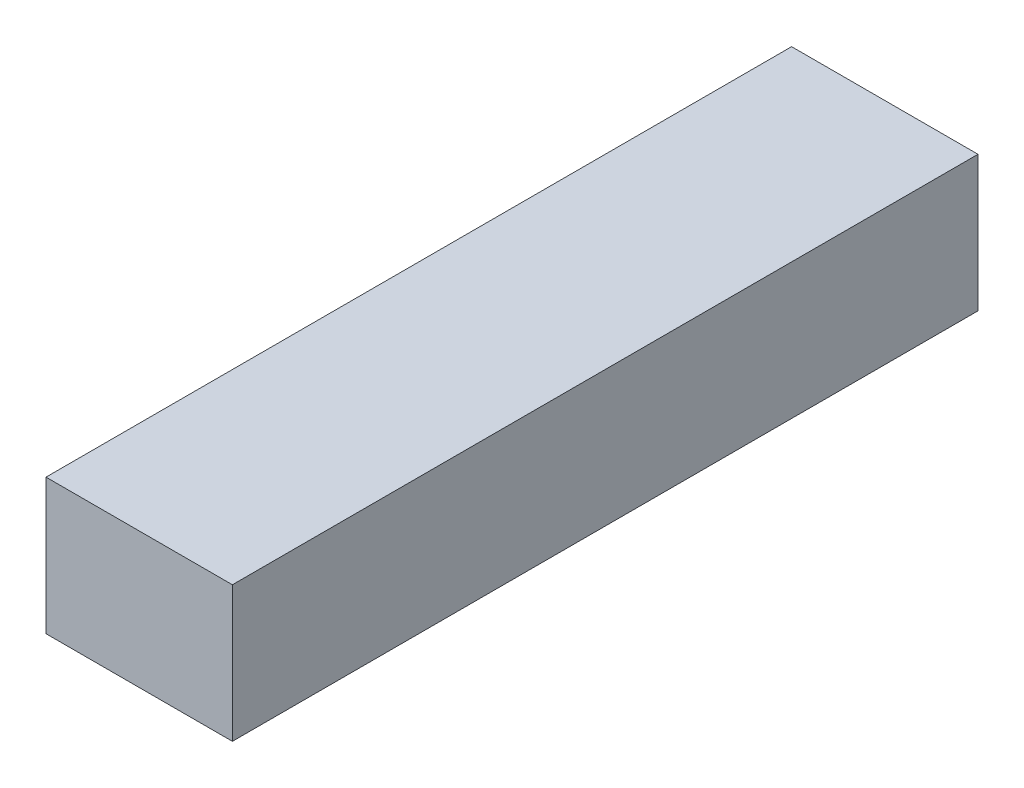
ISO-10303-21;
HEADER;
FILE_DESCRIPTION(('STEP AP214'),'2;1');
FILE_NAME('part.step','',(''),(''),'','','');
FILE_SCHEMA(('AUTOMOTIVE_DESIGN { 1 0 10303 214 1 1 1 1 }'));
ENDSEC;
DATA;
#1=APPLICATION_CONTEXT('core data for automotive mechanical design processes');
#2=APPLICATION_PROTOCOL_DEFINITION('international standard','automotive_design',2000,#1);
#3=PRODUCT_CONTEXT('',#1,'mechanical');
#4=PRODUCT('Part','Part','',(#3));
#5=PRODUCT_RELATED_PRODUCT_CATEGORY('part','',(#4));
#6=PRODUCT_DEFINITION_FORMATION('','',#4);
#7=PRODUCT_DEFINITION_CONTEXT('part definition',#1,'design');
#8=PRODUCT_DEFINITION('design','',#6,#7);
#9=PRODUCT_DEFINITION_SHAPE('','',#8);
#10=(LENGTH_UNIT() NAMED_UNIT(*) SI_UNIT(.MILLI.,.METRE.));
#11=(NAMED_UNIT(*) PLANE_ANGLE_UNIT() SI_UNIT($,.RADIAN.));
#12=(NAMED_UNIT(*) SI_UNIT($,.STERADIAN.) SOLID_ANGLE_UNIT());
#13=UNCERTAINTY_MEASURE_WITH_UNIT(LENGTH_MEASURE(1.E-05),#10,'distance_accuracy_value','');
#14=(GEOMETRIC_REPRESENTATION_CONTEXT(3) GLOBAL_UNCERTAINTY_ASSIGNED_CONTEXT((#13)) GLOBAL_UNIT_ASSIGNED_CONTEXT((#10,
#11,#12)) REPRESENTATION_CONTEXT('',''));
#15=CARTESIAN_POINT('',(0.,0.,0.));
#16=DIRECTION('',(0.,0.,1.));
#17=DIRECTION('',(1.,0.,0.));
#18=AXIS2_PLACEMENT_3D('',#15,#16,#17);
#19=CARTESIAN_POINT('',(-3.175,-2.31,25.4));
#20=DIRECTION('',(1.,0.,0.));
#21=DIRECTION('',(0.,0.,-1.));
#22=AXIS2_PLACEMENT_3D('',#19,#20,#21);
#23=PLANE('',#22);
#24=DIRECTION('',(0.,-1.,0.));
#25=VECTOR('',#24,1.);
#26=CARTESIAN_POINT('',(-3.175,-2.31,0.));
#27=LINE('',#26,#25);
#28=CARTESIAN_POINT('',(-3.175,2.31,0.));
#29=VERTEX_POINT('',#28);
#30=CARTESIAN_POINT('',(-3.175,-2.31,0.));
#31=VERTEX_POINT('',#30);
#32=EDGE_CURVE('E96',#29,#31,#27,.T.);
#33=ORIENTED_EDGE('',*,*,#32,.T.);
#34=DIRECTION('',(0.,0.,-1.));
#35=VECTOR('',#34,1.);
#36=CARTESIAN_POINT('',(-3.175,-2.31,25.4));
#37=LINE('',#36,#35);
#38=CARTESIAN_POINT('',(-3.175,-2.31,25.4));
#39=VERTEX_POINT('',#38);
#40=EDGE_CURVE('E11',#39,#31,#37,.T.);
#41=ORIENTED_EDGE('',*,*,#40,.F.);
#42=DIRECTION('',(0.,-1.,0.));
#43=VECTOR('',#42,1.);
#44=CARTESIAN_POINT('',(-3.175,-2.31,25.4));
#45=LINE('',#44,#43);
#46=CARTESIAN_POINT('',(-3.175,2.31,25.4));
#47=VERTEX_POINT('',#46);
#48=EDGE_CURVE('E84',#47,#39,#45,.T.);
#49=ORIENTED_EDGE('',*,*,#48,.F.);
#50=DIRECTION('',(0.,0.,-1.));
#51=VECTOR('',#50,1.);
#52=CARTESIAN_POINT('',(-3.175,2.31,25.4));
#53=LINE('',#52,#51);
#54=EDGE_CURVE('E92',#47,#29,#53,.T.);
#55=ORIENTED_EDGE('',*,*,#54,.T.);
#56=EDGE_LOOP('',(#33,#41,#49,#55));
#57=FACE_BOUND('',#56,.T.);
#58=ADVANCED_FACE('F33',(#57),#23,.F.);
#59=CARTESIAN_POINT('',(3.175,-2.31,25.4));
#60=DIRECTION('',(0.,1.,0.));
#61=DIRECTION('',(0.,0.,1.));
#62=AXIS2_PLACEMENT_3D('',#59,#60,#61);
#63=PLANE('',#62);
#64=DIRECTION('',(1.,0.,0.));
#65=VECTOR('',#64,1.);
#66=CARTESIAN_POINT('',(3.175,-2.31,0.));
#67=LINE('',#66,#65);
#68=CARTESIAN_POINT('',(3.175,-2.31,0.));
#69=VERTEX_POINT('',#68);
#70=EDGE_CURVE('E88',#31,#69,#67,.T.);
#71=ORIENTED_EDGE('',*,*,#70,.T.);
#72=DIRECTION('',(0.,0.,-1.));
#73=VECTOR('',#72,1.);
#74=CARTESIAN_POINT('',(3.175,-2.31,25.4));
#75=LINE('',#74,#73);
#76=CARTESIAN_POINT('',(3.175,-2.31,25.4));
#77=VERTEX_POINT('',#76);
#78=EDGE_CURVE('E41',#77,#69,#75,.T.);
#79=ORIENTED_EDGE('',*,*,#78,.F.);
#80=DIRECTION('',(1.,0.,0.));
#81=VECTOR('',#80,1.);
#82=CARTESIAN_POINT('',(3.175,-2.31,25.4));
#83=LINE('',#82,#81);
#84=EDGE_CURVE('E79',#39,#77,#83,.T.);
#85=ORIENTED_EDGE('',*,*,#84,.F.);
#86=ORIENTED_EDGE('',*,*,#40,.T.);
#87=EDGE_LOOP('',(#71,#79,#85,#86));
#88=FACE_BOUND('',#87,.T.);
#89=ADVANCED_FACE('F87',(#88),#63,.F.);
#90=CARTESIAN_POINT('',(3.175,-2.31,25.4));
#91=DIRECTION('',(-1.,0.,0.));
#92=DIRECTION('',(0.,0.,1.));
#93=AXIS2_PLACEMENT_3D('',#90,#91,#92);
#94=PLANE('',#93);
#95=DIRECTION('',(0.,1.,0.));
#96=VECTOR('',#95,1.);
#97=CARTESIAN_POINT('',(3.175,-2.31,0.));
#98=LINE('',#97,#96);
#99=CARTESIAN_POINT('',(3.175,2.31,0.));
#100=VERTEX_POINT('',#99);
#101=EDGE_CURVE('E66',#69,#100,#98,.T.);
#102=ORIENTED_EDGE('',*,*,#101,.T.);
#103=DIRECTION('',(0.,0.,-1.));
#104=VECTOR('',#103,1.);
#105=CARTESIAN_POINT('',(3.175,2.31,25.4));
#106=LINE('',#105,#104);
#107=CARTESIAN_POINT('',(3.175,2.31,25.4));
#108=VERTEX_POINT('',#107);
#109=EDGE_CURVE('E89',#108,#100,#106,.T.);
#110=ORIENTED_EDGE('',*,*,#109,.F.);
#111=DIRECTION('',(0.,1.,0.));
#112=VECTOR('',#111,1.);
#113=CARTESIAN_POINT('',(3.175,-2.31,25.4));
#114=LINE('',#113,#112);
#115=EDGE_CURVE('E82',#77,#108,#114,.T.);
#116=ORIENTED_EDGE('',*,*,#115,.F.);
#117=ORIENTED_EDGE('',*,*,#78,.T.);
#118=EDGE_LOOP('',(#102,#110,#116,#117));
#119=FACE_BOUND('',#118,.T.);
#120=ADVANCED_FACE('F90',(#119),#94,.F.);
#121=CARTESIAN_POINT('',(3.175,2.31,25.4));
#122=DIRECTION('',(0.,-1.,0.));
#123=DIRECTION('',(0.,0.,-1.));
#124=AXIS2_PLACEMENT_3D('',#121,#122,#123);
#125=PLANE('',#124);
#126=DIRECTION('',(-1.,0.,0.));
#127=VECTOR('',#126,1.);
#128=CARTESIAN_POINT('',(3.175,2.31,0.));
#129=LINE('',#128,#127);
#130=EDGE_CURVE('E72',#100,#29,#129,.T.);
#131=ORIENTED_EDGE('',*,*,#130,.T.);
#132=ORIENTED_EDGE('',*,*,#54,.F.);
#133=DIRECTION('',(-1.,0.,0.));
#134=VECTOR('',#133,1.);
#135=CARTESIAN_POINT('',(3.175,2.31,25.4));
#136=LINE('',#135,#134);
#137=EDGE_CURVE('E49',#108,#47,#136,.T.);
#138=ORIENTED_EDGE('',*,*,#137,.F.);
#139=ORIENTED_EDGE('',*,*,#109,.T.);
#140=EDGE_LOOP('',(#131,#132,#138,#139));
#141=FACE_BOUND('',#140,.T.);
#142=ADVANCED_FACE('F103',(#141),#125,.F.);
#143=CARTESIAN_POINT('',(0.,0.,25.4));
#144=DIRECTION('',(0.,0.,1.));
#145=DIRECTION('',(1.,0.,0.));
#146=AXIS2_PLACEMENT_3D('',#143,#144,#145);
#147=PLANE('',#146);
#148=ORIENTED_EDGE('',*,*,#48,.T.);
#149=ORIENTED_EDGE('',*,*,#84,.T.);
#150=ORIENTED_EDGE('',*,*,#115,.T.);
#151=ORIENTED_EDGE('',*,*,#137,.T.);
#152=EDGE_LOOP('',(#148,#149,#150,#151));
#153=FACE_BOUND('',#152,.T.);
#154=ADVANCED_FACE('F80',(#153),#147,.T.);
#155=CARTESIAN_POINT('',(0.,0.,0.));
#156=DIRECTION('',(0.,0.,1.));
#157=DIRECTION('',(1.,0.,0.));
#158=AXIS2_PLACEMENT_3D('',#155,#156,#157);
#159=PLANE('',#158);
#160=ORIENTED_EDGE('',*,*,#32,.F.);
#161=ORIENTED_EDGE('',*,*,#130,.F.);
#162=ORIENTED_EDGE('',*,*,#101,.F.);
#163=ORIENTED_EDGE('',*,*,#70,.F.);
#164=EDGE_LOOP('',(#160,#161,#162,#163));
#165=FACE_BOUND('',#164,.T.);
#166=ADVANCED_FACE('F106',(#165),#159,.F.);
#167=CLOSED_SHELL('',(#58,#89,#120,#142,#154,#166));
#168=MANIFOLD_SOLID_BREP('B2',#167);
#169=ADVANCED_BREP_SHAPE_REPRESENTATION('',(#18,#168),#14);
#170=SHAPE_DEFINITION_REPRESENTATION(#9,#169);
ENDSEC;
END-ISO-10303-21;
